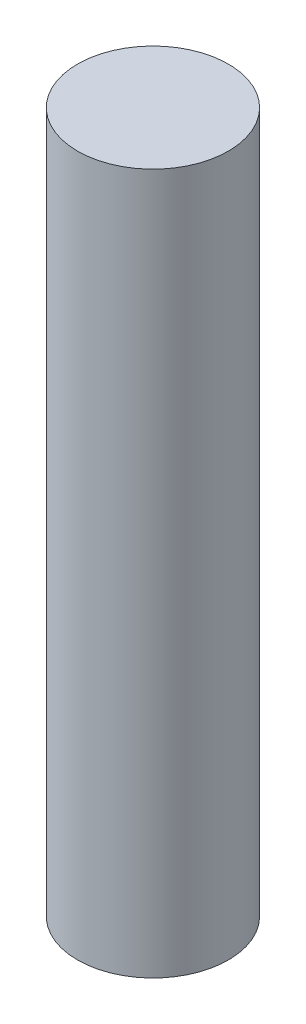
ISO-10303-21;
HEADER;
FILE_DESCRIPTION(('STEP AP214'),'2;1');
FILE_NAME('part.step','',(''),(''),'','','');
FILE_SCHEMA(('AUTOMOTIVE_DESIGN { 1 0 10303 214 1 1 1 1 }'));
ENDSEC;
DATA;
#1=APPLICATION_CONTEXT('core data for automotive mechanical design processes');
#2=APPLICATION_PROTOCOL_DEFINITION('international standard','automotive_design',2000,#1);
#3=PRODUCT_CONTEXT('',#1,'mechanical');
#4=PRODUCT('Part','Part','',(#3));
#5=PRODUCT_RELATED_PRODUCT_CATEGORY('part','',(#4));
#6=PRODUCT_DEFINITION_FORMATION('','',#4);
#7=PRODUCT_DEFINITION_CONTEXT('part definition',#1,'design');
#8=PRODUCT_DEFINITION('design','',#6,#7);
#9=PRODUCT_DEFINITION_SHAPE('','',#8);
#10=(LENGTH_UNIT() NAMED_UNIT(*) SI_UNIT(.MILLI.,.METRE.));
#11=(NAMED_UNIT(*) PLANE_ANGLE_UNIT() SI_UNIT($,.RADIAN.));
#12=(NAMED_UNIT(*) SI_UNIT($,.STERADIAN.) SOLID_ANGLE_UNIT());
#13=UNCERTAINTY_MEASURE_WITH_UNIT(LENGTH_MEASURE(1.E-05),#10,'distance_accuracy_value','');
#14=(GEOMETRIC_REPRESENTATION_CONTEXT(3) GLOBAL_UNCERTAINTY_ASSIGNED_CONTEXT((#13)) GLOBAL_UNIT_ASSIGNED_CONTEXT((#10,
#11,#12)) REPRESENTATION_CONTEXT('',''));
#15=CARTESIAN_POINT('',(0.,0.,0.));
#16=DIRECTION('',(0.,0.,1.));
#17=DIRECTION('',(1.,0.,0.));
#18=AXIS2_PLACEMENT_3D('',#15,#16,#17);
#19=CARTESIAN_POINT('',(0.,10.,0.));
#20=DIRECTION('',(0.,-1.,0.));
#21=DIRECTION('',(0.,0.,-1.));
#22=AXIS2_PLACEMENT_3D('',#19,#20,#21);
#23=CYLINDRICAL_SURFACE('',#22,1.4);
#24=CARTESIAN_POINT('',(0.,0.,0.));
#25=DIRECTION('',(0.,1.,0.));
#26=DIRECTION('',(0.,0.,1.));
#27=AXIS2_PLACEMENT_3D('',#24,#25,#26);
#28=CIRCLE('',#27,1.4);
#29=CARTESIAN_POINT('',(0.,0.,1.4));
#30=VERTEX_POINT('',#29);
#31=EDGE_CURVE('E10',#30,#30,#28,.T.);
#32=ORIENTED_EDGE('',*,*,#31,.T.);
#33=EDGE_LOOP('',(#32));
#34=FACE_BOUND('',#33,.T.);
#35=CARTESIAN_POINT('',(0.,13.,0.));
#36=DIRECTION('',(0.,1.,0.));
#37=DIRECTION('',(0.,0.,1.));
#38=AXIS2_PLACEMENT_3D('',#35,#36,#37);
#39=CIRCLE('',#38,1.4);
#40=CARTESIAN_POINT('',(0.,13.,1.4));
#41=VERTEX_POINT('',#40);
#42=EDGE_CURVE('E47',#41,#41,#39,.T.);
#43=ORIENTED_EDGE('',*,*,#42,.F.);
#44=EDGE_LOOP('',(#43));
#45=FACE_BOUND('',#44,.T.);
#46=ADVANCED_FACE('F41',(#34,#45),#23,.T.);
#47=CARTESIAN_POINT('',(0.,0.,0.));
#48=DIRECTION('',(0.,1.,0.));
#49=DIRECTION('',(0.,0.,1.));
#50=AXIS2_PLACEMENT_3D('',#47,#48,#49);
#51=PLANE('',#50);
#52=ORIENTED_EDGE('',*,*,#31,.F.);
#53=EDGE_LOOP('',(#52));
#54=FACE_BOUND('',#53,.T.);
#55=ADVANCED_FACE('F56',(#54),#51,.F.);
#56=CARTESIAN_POINT('',(0.,13.,0.));
#57=DIRECTION('',(0.,1.,0.));
#58=DIRECTION('',(0.,0.,1.));
#59=AXIS2_PLACEMENT_3D('',#56,#57,#58);
#60=PLANE('',#59);
#61=ORIENTED_EDGE('',*,*,#42,.T.);
#62=EDGE_LOOP('',(#61));
#63=FACE_BOUND('',#62,.T.);
#64=ADVANCED_FACE('F53',(#63),#60,.T.);
#65=CLOSED_SHELL('',(#46,#55,#64));
#66=MANIFOLD_SOLID_BREP('B2',#65);
#67=ADVANCED_BREP_SHAPE_REPRESENTATION('',(#18,#66),#14);
#68=SHAPE_DEFINITION_REPRESENTATION(#9,#67);
ENDSEC;
END-ISO-10303-21;
